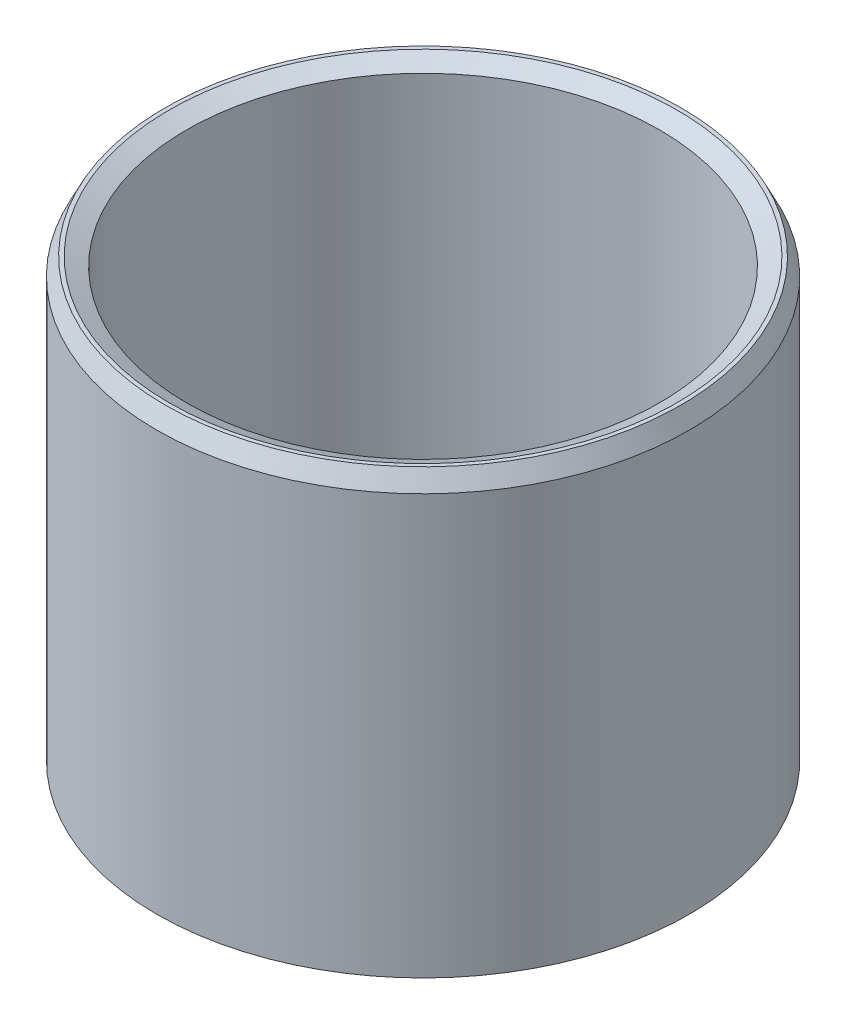
ISO-10303-21;
HEADER;
FILE_DESCRIPTION(('STEP AP214'),'2;1');
FILE_NAME('part.step','',(''),(''),'','','');
FILE_SCHEMA(('AUTOMOTIVE_DESIGN { 1 0 10303 214 1 1 1 1 }'));
ENDSEC;
DATA;
#1=APPLICATION_CONTEXT('core data for automotive mechanical design processes');
#2=APPLICATION_PROTOCOL_DEFINITION('international standard','automotive_design',2000,#1);
#3=PRODUCT_CONTEXT('',#1,'mechanical');
#4=PRODUCT('Part','Part','',(#3));
#5=PRODUCT_RELATED_PRODUCT_CATEGORY('part','',(#4));
#6=PRODUCT_DEFINITION_FORMATION('','',#4);
#7=PRODUCT_DEFINITION_CONTEXT('part definition',#1,'design');
#8=PRODUCT_DEFINITION('design','',#6,#7);
#9=PRODUCT_DEFINITION_SHAPE('','',#8);
#10=(LENGTH_UNIT() NAMED_UNIT(*) SI_UNIT(.MILLI.,.METRE.));
#11=(NAMED_UNIT(*) PLANE_ANGLE_UNIT() SI_UNIT($,.RADIAN.));
#12=(NAMED_UNIT(*) SI_UNIT($,.STERADIAN.) SOLID_ANGLE_UNIT());
#13=UNCERTAINTY_MEASURE_WITH_UNIT(LENGTH_MEASURE(1.E-05),#10,'distance_accuracy_value','');
#14=(GEOMETRIC_REPRESENTATION_CONTEXT(3) GLOBAL_UNCERTAINTY_ASSIGNED_CONTEXT((#13)) GLOBAL_UNIT_ASSIGNED_CONTEXT((#10,
#11,#12)) REPRESENTATION_CONTEXT('',''));
#15=CARTESIAN_POINT('',(0.,0.,0.));
#16=DIRECTION('',(0.,0.,1.));
#17=DIRECTION('',(1.,0.,0.));
#18=AXIS2_PLACEMENT_3D('',#15,#16,#17);
#19=CARTESIAN_POINT('',(0.,100.301734389991,0.));
#20=DIRECTION('',(0.,-1.,0.));
#21=DIRECTION('',(0.,0.,-1.));
#22=AXIS2_PLACEMENT_3D('',#19,#20,#21);
#23=CYLINDRICAL_SURFACE('',#22,60.);
#24=CARTESIAN_POINT('',(0.,1.94162444039368,0.));
#25=DIRECTION('',(0.,1.,0.));
#26=DIRECTION('',(0.,0.,1.));
#27=AXIS2_PLACEMENT_3D('',#24,#25,#26);
#28=CIRCLE('',#27,60.);
#29=CARTESIAN_POINT('',(0.,1.94162444039368,60.));
#30=VERTEX_POINT('',#29);
#31=EDGE_CURVE('E10',#30,#30,#28,.T.);
#32=ORIENTED_EDGE('',*,*,#31,.T.);
#33=EDGE_LOOP('',(#32));
#34=FACE_BOUND('',#33,.T.);
#35=CARTESIAN_POINT('',(0.,96.4065089309638,0.));
#36=DIRECTION('',(0.,1.,0.));
#37=DIRECTION('',(0.,0.,1.));
#38=AXIS2_PLACEMENT_3D('',#35,#36,#37);
#39=CIRCLE('',#38,60.);
#40=CARTESIAN_POINT('',(0.,96.4065089309638,60.));
#41=VERTEX_POINT('',#40);
#42=EDGE_CURVE('E50',#41,#41,#39,.F.);
#43=ORIENTED_EDGE('',*,*,#42,.T.);
#44=EDGE_LOOP('',(#43));
#45=FACE_BOUND('',#44,.T.);
#46=ADVANCED_FACE('F39',(#34,#45),#23,.T.);
#47=CARTESIAN_POINT('',(0.,100.301734389991,0.));
#48=DIRECTION('',(0.,1.,0.));
#49=DIRECTION('',(0.,0.,1.));
#50=AXIS2_PLACEMENT_3D('',#47,#48,#49);
#51=PLANE('',#50);
#52=CARTESIAN_POINT('',(0.,100.301734389991,0.));
#53=DIRECTION('',(0.,1.,0.));
#54=DIRECTION('',(0.,0.,1.));
#55=AXIS2_PLACEMENT_3D('',#52,#53,#54);
#56=CIRCLE('',#55,57.1720234474292);
#57=CARTESIAN_POINT('',(0.,100.301734389991,57.1720234474292));
#58=VERTEX_POINT('',#57);
#59=EDGE_CURVE('E58',#58,#58,#56,.F.);
#60=ORIENTED_EDGE('',*,*,#59,.T.);
#61=EDGE_LOOP('',(#60));
#62=FACE_BOUND('',#61,.T.);
#63=CARTESIAN_POINT('',(0.,100.301734389991,0.));
#64=DIRECTION('',(0.,1.,0.));
#65=DIRECTION('',(0.,0.,1.));
#66=AXIS2_PLACEMENT_3D('',#63,#64,#65);
#67=CIRCLE('',#66,58.0583755596063);
#68=CARTESIAN_POINT('',(0.,100.301734389991,58.0583755596063));
#69=VERTEX_POINT('',#68);
#70=EDGE_CURVE('E61',#69,#69,#67,.T.);
#71=ORIENTED_EDGE('',*,*,#70,.T.);
#72=EDGE_LOOP('',(#71));
#73=FACE_BOUND('',#72,.T.);
#74=ADVANCED_FACE('F88',(#62,#73),#51,.T.);
#75=CARTESIAN_POINT('',(0.,0.,0.));
#76=DIRECTION('',(0.,1.,0.));
#77=DIRECTION('',(0.,0.,1.));
#78=AXIS2_PLACEMENT_3D('',#75,#76,#77);
#79=PLANE('',#78);
#80=CARTESIAN_POINT('',(0.,0.,0.));
#81=DIRECTION('',(0.,1.,0.));
#82=DIRECTION('',(0.,0.,1.));
#83=AXIS2_PLACEMENT_3D('',#80,#81,#82);
#84=CIRCLE('',#83,55.218422428796);
#85=CARTESIAN_POINT('',(0.,0.,55.218422428796));
#86=VERTEX_POINT('',#85);
#87=EDGE_CURVE('E51',#86,#86,#84,.T.);
#88=ORIENTED_EDGE('',*,*,#87,.T.);
#89=EDGE_LOOP('',(#88));
#90=FACE_BOUND('',#89,.T.);
#91=CARTESIAN_POINT('',(0.,0.,0.));
#92=DIRECTION('',(0.,1.,0.));
#93=DIRECTION('',(0.,0.,1.));
#94=AXIS2_PLACEMENT_3D('',#91,#92,#93);
#95=CIRCLE('',#94,56.104774540973);
#96=CARTESIAN_POINT('',(0.,0.,56.104774540973));
#97=VERTEX_POINT('',#96);
#98=EDGE_CURVE('E54',#97,#97,#95,.F.);
#99=ORIENTED_EDGE('',*,*,#98,.T.);
#100=EDGE_LOOP('',(#99));
#101=FACE_BOUND('',#100,.T.);
#102=ADVANCED_FACE('F83',(#90,#101),#79,.F.);
#103=CARTESIAN_POINT('',(0.,100.301734389991,0.));
#104=DIRECTION('',(0.,-1.,0.));
#105=DIRECTION('',(0.,0.,-1.));
#106=AXIS2_PLACEMENT_3D('',#103,#104,#105);
#107=CYLINDRICAL_SURFACE('',#106,53.2767979884023);
#108=CARTESIAN_POINT('',(0.,98.360109949597,0.));
#109=DIRECTION('',(0.,1.,0.));
#110=DIRECTION('',(0.,0.,1.));
#111=AXIS2_PLACEMENT_3D('',#108,#109,#110);
#112=CIRCLE('',#111,53.2767979884023);
#113=CARTESIAN_POINT('',(0.,98.360109949597,53.2767979884023));
#114=VERTEX_POINT('',#113);
#115=EDGE_CURVE('E67',#114,#114,#112,.T.);
#116=ORIENTED_EDGE('',*,*,#115,.T.);
#117=EDGE_LOOP('',(#116));
#118=FACE_BOUND('',#117,.T.);
#119=CARTESIAN_POINT('',(0.,3.89522545902699,0.));
#120=DIRECTION('',(0.,1.,0.));
#121=DIRECTION('',(0.,0.,1.));
#122=AXIS2_PLACEMENT_3D('',#119,#120,#121);
#123=CIRCLE('',#122,53.2767979884023);
#124=CARTESIAN_POINT('',(0.,3.89522545902699,53.2767979884023));
#125=VERTEX_POINT('',#124);
#126=EDGE_CURVE('E69',#125,#125,#123,.F.);
#127=ORIENTED_EDGE('',*,*,#126,.T.);
#128=EDGE_LOOP('',(#127));
#129=FACE_BOUND('',#128,.T.);
#130=ADVANCED_FACE('F71',(#118,#129),#107,.F.);
#131=CARTESIAN_POINT('',(0.,98.360109949597,0.));
#132=DIRECTION('',(0.,1.,0.));
#133=DIRECTION('',(0.,0.,1.));
#134=AXIS2_PLACEMENT_3D('',#131,#132,#133);
#135=CONICAL_SURFACE('',#134,53.2767979884023,1.10837934659139);
#136=CARTESIAN_POINT('',(0.,100.301734389991,57.1720234474292));
#137=CARTESIAN_POINT('',(0.,100.281509135403,57.131448182231));
#138=CARTESIAN_POINT('',(0.,100.261283880816,57.0908729170328));
#139=CARTESIAN_POINT('',(0.,100.220833371641,57.0097223866364));
#140=CARTESIAN_POINT('',(0.,100.200608117054,56.9691471214382));
#141=CARTESIAN_POINT('',(0.,100.160157607879,56.8879965910418));
#142=CARTESIAN_POINT('',(0.,100.139932353291,56.8474213258436));
#143=CARTESIAN_POINT('',(0.,100.099481844116,56.7662707954472));
#144=CARTESIAN_POINT('',(0.,100.079256589529,56.725695530249));
#145=CARTESIAN_POINT('',(0.,100.038806080354,56.6445449998526));
#146=CARTESIAN_POINT('',(0.,100.018580825767,56.6039697346544));
#147=CARTESIAN_POINT('',(0.,99.9781303165917,56.522819204258));
#148=CARTESIAN_POINT('',(0.,99.9579050620043,56.4822439390598));
#149=CARTESIAN_POINT('',(0.,99.9174545528294,56.4010934086635));
#150=CARTESIAN_POINT('',(0.,99.897229298242,56.3605181434653));
#151=CARTESIAN_POINT('',(0.,99.8567787890671,56.2793676130689));
#152=CARTESIAN_POINT('',(0.,99.8365535344797,56.2387923478707));
#153=CARTESIAN_POINT('',(0.,99.7961030253048,56.1576418174743));
#154=CARTESIAN_POINT('',(0.,99.7758777707174,56.1170665522761));
#155=CARTESIAN_POINT('',(0.,99.7354272615425,56.0359160218797));
#156=CARTESIAN_POINT('',(0.,99.7152020069551,55.9953407566815));
#157=CARTESIAN_POINT('',(0.,99.6747514977802,55.9141902262851));
#158=CARTESIAN_POINT('',(0.,99.6545262431928,55.8736149610869));
#159=CARTESIAN_POINT('',(0.,99.6140757340179,55.7924644306905));
#160=CARTESIAN_POINT('',(0.,99.5938504794305,55.7518891654923));
#161=CARTESIAN_POINT('',(0.,99.5533999702556,55.6707386350959));
#162=CARTESIAN_POINT('',(0.,99.5331747156682,55.6301633698977));
#163=CARTESIAN_POINT('',(0.,99.4927242064933,55.5490128395013));
#164=CARTESIAN_POINT('',(0.,99.4724989519059,55.5084375743031));
#165=CARTESIAN_POINT('',(0.,99.432048442731,55.4272870439067));
#166=CARTESIAN_POINT('',(0.,99.4118231881436,55.3867117787085));
#167=CARTESIAN_POINT('',(0.,99.3713726789687,55.3055612483121));
#168=CARTESIAN_POINT('',(0.,99.3511474243813,55.2649859831139));
#169=CARTESIAN_POINT('',(0.,99.3106969152064,55.1838354527175));
#170=CARTESIAN_POINT('',(0.,99.290471660619,55.1432601875193));
#171=CARTESIAN_POINT('',(0.,99.2500211514441,55.062109657123));
#172=CARTESIAN_POINT('',(0.,99.2297958968567,55.0215343919248));
#173=CARTESIAN_POINT('',(0.,99.1893453876818,54.9403838615284));
#174=CARTESIAN_POINT('',(0.,99.1691201330944,54.8998085963302));
#175=CARTESIAN_POINT('',(0.,99.1286696239195,54.8186580659338));
#176=CARTESIAN_POINT('',(0.,99.1084443693321,54.7780828007356));
#177=CARTESIAN_POINT('',(0.,99.0679938601572,54.6969322703392));
#178=CARTESIAN_POINT('',(0.,99.0477686055698,54.656357005141));
#179=CARTESIAN_POINT('',(0.,99.0073180963949,54.5752064747446));
#180=CARTESIAN_POINT('',(0.,98.9870928418075,54.5346312095464));
#181=CARTESIAN_POINT('',(0.,98.9466423326326,54.45348067915));
#182=CARTESIAN_POINT('',(0.,98.9264170780452,54.4129054139518));
#183=CARTESIAN_POINT('',(0.,98.8859665688703,54.3317548835554));
#184=CARTESIAN_POINT('',(0.,98.8657413142829,54.2911796183572));
#185=CARTESIAN_POINT('',(0.,98.825290805108,54.2100290879608));
#186=CARTESIAN_POINT('',(0.,98.8050655505206,54.1694538227626));
#187=CARTESIAN_POINT('',(0.,98.7646150413457,54.0883032923662));
#188=CARTESIAN_POINT('',(0.,98.7443897867583,54.047728027168));
#189=CARTESIAN_POINT('',(0.,98.7039392775834,53.9665774967716));
#190=CARTESIAN_POINT('',(0.,98.6837140229959,53.9260022315734));
#191=CARTESIAN_POINT('',(0.,98.6432635138211,53.844851701177));
#192=CARTESIAN_POINT('',(0.,98.6230382592336,53.8042764359788));
#193=CARTESIAN_POINT('',(0.,98.5825877500588,53.7231259055824));
#194=CARTESIAN_POINT('',(0.,98.5623624954713,53.6825506403842));
#195=CARTESIAN_POINT('',(0.,98.5219119862965,53.6014001099878));
#196=CARTESIAN_POINT('',(0.,98.501686731709,53.5608248447897));
#197=CARTESIAN_POINT('',(0.,98.4612362225342,53.4796743143933));
#198=CARTESIAN_POINT('',(0.,98.4410109679468,53.4390990491951));
#199=CARTESIAN_POINT('',(0.,98.4005604587719,53.3579485187987));
#200=CARTESIAN_POINT('',(0.,98.3803352041844,53.3173732536005));
#201=CARTESIAN_POINT('',(0.,98.360109949597,53.2767979884023));
#202=B_SPLINE_CURVE_WITH_KNOTS('',3,(#136,#137,#138,#139,#140,#141,#142,#143,#144,#145,#146,
#147,#148,#149,#150,#151,#152,#153,#154,#155,#156,#157,#158,#159,#160,#161,#162,#163,#164,#165,
#166,#167,#168,#169,#170,#171,#172,#173,#174,#175,#176,#177,#178,#179,#180,#181,#182,#183,#184,
#185,#186,#187,#188,#189,#190,#191,#192,#193,#194,#195,#196,#197,#198,#199,#200,#201),
.UNSPECIFIED.,.F.,.F.,(4,2,2,2,2,2,2,2,2,2,2,2,2,2,2,2,2,2,2,2,2,2,2,2,2,2,2,2,2,2,2,2,4),(0.,
0.13600999088771,0.272019981775421,0.408029972663125,0.544039963550836,0.680049954438546,
0.816059945326263,0.952069936213967,1.08807992710168,1.22408991798939,1.3600999088771,
1.49610989976481,1.63211989065252,1.76812988154023,1.90413987242794,2.04014986331565,
2.17615985420336,2.31216984509107,2.44817983597878,2.58418982686649,2.7201998177542,
2.85620980864191,2.99221979952962,3.12822979041733,3.26423978130504,3.40024977219275,
3.53625976308046,3.67226975396817,3.80827974485588,3.94428973574359,4.0802997266313,
4.21630971751901,4.35231970840672),.UNSPECIFIED.);
#203=EDGE_CURVE('BSEAM77',#58,#114,#202,.T.);
#204=ORIENTED_EDGE('',*,*,#59,.F.);
#205=ORIENTED_EDGE('',*,*,#115,.F.);
#206=ORIENTED_EDGE('',*,*,#203,.T.);
#207=ORIENTED_EDGE('',*,*,#203,.F.);
#208=EDGE_LOOP('',(#204,#206,#205,#207));
#209=FACE_BOUND('',#208,.T.);
#210=ADVANCED_FACE('F77',(#209),#135,.F.);
#211=CARTESIAN_POINT('',(0.,0.,0.));
#212=DIRECTION('',(0.,-1.,0.));
#213=DIRECTION('',(0.,0.,-1.));
#214=AXIS2_PLACEMENT_3D('',#211,#212,#213);
#215=CONICAL_SURFACE('',#214,55.218422428796,0.462416980203501);
#216=ORIENTED_EDGE('',*,*,#126,.F.);
#217=EDGE_LOOP('',(#216));
#218=FACE_BOUND('',#217,.T.);
#219=ORIENTED_EDGE('',*,*,#87,.F.);
#220=EDGE_LOOP('',(#219));
#221=FACE_BOUND('',#220,.T.);
#222=ADVANCED_FACE('F73',(#218,#221),#215,.F.);
#223=CARTESIAN_POINT('',(0.,1.94162444039368,0.));
#224=DIRECTION('',(0.,1.,0.));
#225=DIRECTION('',(0.,0.,1.));
#226=AXIS2_PLACEMENT_3D('',#223,#224,#225);
#227=CONICAL_SURFACE('',#226,60.,1.1083793465914);
#228=ORIENTED_EDGE('',*,*,#98,.F.);
#229=EDGE_LOOP('',(#228));
#230=FACE_BOUND('',#229,.T.);
#231=ORIENTED_EDGE('',*,*,#31,.F.);
#232=EDGE_LOOP('',(#231));
#233=FACE_BOUND('',#232,.T.);
#234=ADVANCED_FACE('F76',(#230,#233),#227,.T.);
#235=CARTESIAN_POINT('',(0.,100.301734389991,0.));
#236=DIRECTION('',(0.,-1.,0.));
#237=DIRECTION('',(0.,0.,-1.));
#238=AXIS2_PLACEMENT_3D('',#235,#236,#237);
#239=CONICAL_SURFACE('',#238,58.0583755596063,0.462416980203502);
#240=ORIENTED_EDGE('',*,*,#42,.F.);
#241=EDGE_LOOP('',(#240));
#242=FACE_BOUND('',#241,.T.);
#243=ORIENTED_EDGE('',*,*,#70,.F.);
#244=EDGE_LOOP('',(#243));
#245=FACE_BOUND('',#244,.T.);
#246=ADVANCED_FACE('F45',(#242,#245),#239,.T.);
#247=CLOSED_SHELL('',(#46,#74,#102,#130,#210,#222,#234,#246));
#248=MANIFOLD_SOLID_BREP('B2',#247);
#249=ADVANCED_BREP_SHAPE_REPRESENTATION('',(#18,#248),#14);
#250=SHAPE_DEFINITION_REPRESENTATION(#9,#249);
ENDSEC;
END-ISO-10303-21;
